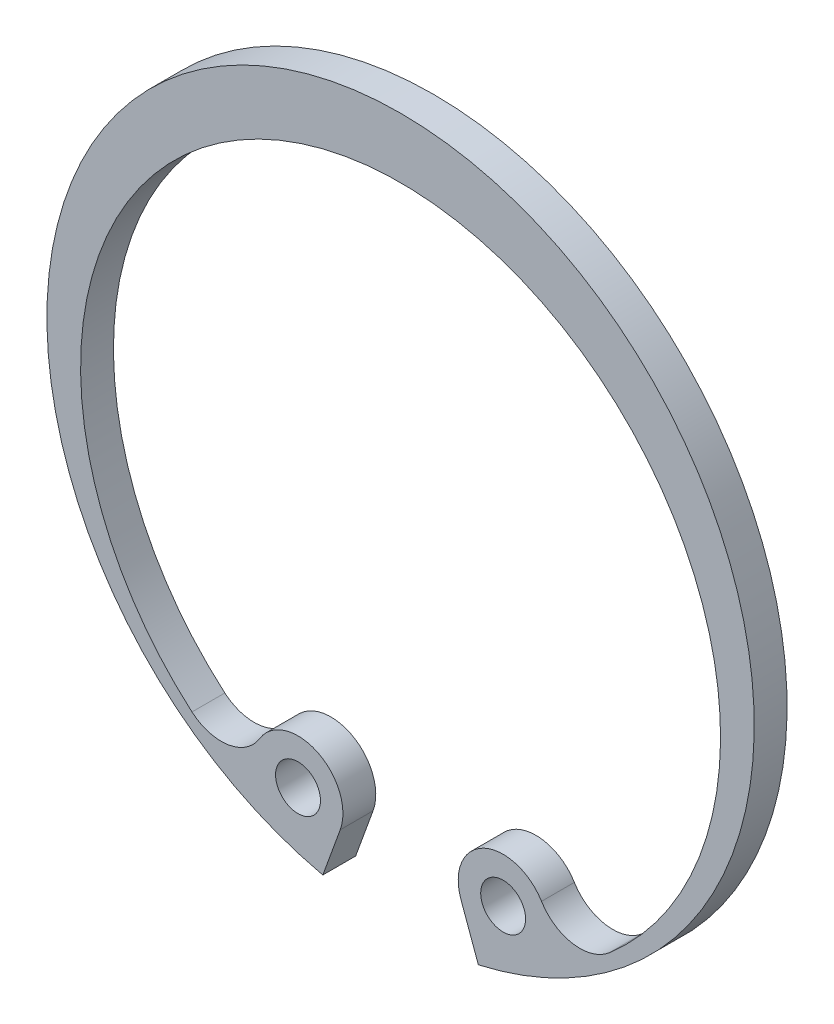
ISO-10303-21;
HEADER;
FILE_DESCRIPTION(('STEP AP214'),'2;1');
FILE_NAME('part.step','',(''),(''),'','','');
FILE_SCHEMA(('AUTOMOTIVE_DESIGN { 1 0 10303 214 1 1 1 1 }'));
ENDSEC;
DATA;
#1=APPLICATION_CONTEXT('core data for automotive mechanical design processes');
#2=APPLICATION_PROTOCOL_DEFINITION('international standard','automotive_design',2000,#1);
#3=PRODUCT_CONTEXT('',#1,'mechanical');
#4=PRODUCT('Part','Part','',(#3));
#5=PRODUCT_RELATED_PRODUCT_CATEGORY('part','',(#4));
#6=PRODUCT_DEFINITION_FORMATION('','',#4);
#7=PRODUCT_DEFINITION_CONTEXT('part definition',#1,'design');
#8=PRODUCT_DEFINITION('design','',#6,#7);
#9=PRODUCT_DEFINITION_SHAPE('','',#8);
#10=(LENGTH_UNIT() NAMED_UNIT(*) SI_UNIT(.MILLI.,.METRE.));
#11=(NAMED_UNIT(*) PLANE_ANGLE_UNIT() SI_UNIT($,.RADIAN.));
#12=(NAMED_UNIT(*) SI_UNIT($,.STERADIAN.) SOLID_ANGLE_UNIT());
#13=UNCERTAINTY_MEASURE_WITH_UNIT(LENGTH_MEASURE(1.E-05),#10,'distance_accuracy_value','');
#14=(GEOMETRIC_REPRESENTATION_CONTEXT(3) GLOBAL_UNCERTAINTY_ASSIGNED_CONTEXT((#13)) GLOBAL_UNIT_ASSIGNED_CONTEXT((#10,
#11,#12)) REPRESENTATION_CONTEXT('',''));
#15=CARTESIAN_POINT('',(0.,0.,0.));
#16=DIRECTION('',(0.,0.,1.));
#17=DIRECTION('',(1.,0.,0.));
#18=AXIS2_PLACEMENT_3D('',#15,#16,#17);
#19=CARTESIAN_POINT('',(0.,0.,0.975));
#20=DIRECTION('',(0.,0.,-1.));
#21=DIRECTION('',(-1.,0.,0.));
#22=AXIS2_PLACEMENT_3D('',#19,#20,#21);
#23=PLANE('',#22);
#24=CARTESIAN_POINT('',(-5.32360078088962,-6.98043795968956,0.975));
#25=DIRECTION('',(0.,0.,-1.));
#26=DIRECTION('',(-1.,0.,0.));
#27=AXIS2_PLACEMENT_3D('',#24,#25,#26);
#28=CIRCLE('',#27,1.33333333333333);
#29=CARTESIAN_POINT('',(-6.19276009205528,-7.99154619800622,0.975));
#30=VERTEX_POINT('',#29);
#31=CARTESIAN_POINT('',(-4.18415582842588,-7.67285617008171,0.975));
#32=VERTEX_POINT('',#31);
#33=EDGE_CURVE('E140',#30,#32,#28,.F.);
#34=ORIENTED_EDGE('',*,*,#33,.T.);
#35=CARTESIAN_POINT('',(-3.04471087596214,-8.36527438047387,0.975));
#36=DIRECTION('',(0.,0.,-1.));
#37=DIRECTION('',(-1.,0.,0.));
#38=AXIS2_PLACEMENT_3D('',#35,#36,#37);
#39=CIRCLE('',#38,1.33333333333333);
#40=CARTESIAN_POINT('',(-1.79178738158093,-8.82130123824143,0.975));
#41=VERTEX_POINT('',#40);
#42=EDGE_CURVE('E96',#41,#32,#39,.F.);
#43=ORIENTED_EDGE('',*,*,#42,.F.);
#44=DIRECTION('',(-0.34202014332567,-0.939692620785908,0.));
#45=VECTOR('',#44,1.);
#46=CARTESIAN_POINT('',(-1.79178738158093,-8.82130123824143,0.975));
#47=LINE('',#46,#45);
#48=CARTESIAN_POINT('',(-2.30921625274565,-10.2429253779404,0.975));
#49=VERTEX_POINT('',#48);
#50=EDGE_CURVE('E93',#41,#49,#47,.T.);
#51=ORIENTED_EDGE('',*,*,#50,.T.);
#52=CARTESIAN_POINT('',(0.,0.,0.975));
#53=DIRECTION('',(0.,0.,-1.));
#54=DIRECTION('',(-1.,0.,0.));
#55=AXIS2_PLACEMENT_3D('',#52,#53,#54);
#56=CIRCLE('',#55,10.5);
#57=CARTESIAN_POINT('',(2.30921625274565,-10.2429253779404,0.975));
#58=VERTEX_POINT('',#57);
#59=EDGE_CURVE('E81',#58,#49,#56,.F.);
#60=ORIENTED_EDGE('',*,*,#59,.F.);
#61=DIRECTION('',(-0.34202014332567,0.939692620785908,0.));
#62=VECTOR('',#61,1.);
#63=CARTESIAN_POINT('',(1.79178738158093,-8.82130123824143,0.975));
#64=LINE('',#63,#62);
#65=CARTESIAN_POINT('',(1.79178738158093,-8.82130123824143,0.975));
#66=VERTEX_POINT('',#65);
#67=EDGE_CURVE('E108',#58,#66,#64,.T.);
#68=ORIENTED_EDGE('',*,*,#67,.T.);
#69=CARTESIAN_POINT('',(3.04471087596214,-8.36527438047387,0.975));
#70=DIRECTION('',(0.,0.,-1.));
#71=DIRECTION('',(-1.,0.,0.));
#72=AXIS2_PLACEMENT_3D('',#69,#70,#71);
#73=CIRCLE('',#72,1.33333333333333);
#74=CARTESIAN_POINT('',(4.18415582842588,-7.67285617008171,0.975));
#75=VERTEX_POINT('',#74);
#76=EDGE_CURVE('E129',#75,#66,#73,.F.);
#77=ORIENTED_EDGE('',*,*,#76,.F.);
#78=CARTESIAN_POINT('',(5.32360078088962,-6.98043795968956,0.975));
#79=DIRECTION('',(0.,0.,-1.));
#80=DIRECTION('',(-1.,0.,0.));
#81=AXIS2_PLACEMENT_3D('',#78,#79,#80);
#82=CIRCLE('',#81,1.33333333333333);
#83=CARTESIAN_POINT('',(6.19276009205528,-7.99154619800622,0.975));
#84=VERTEX_POINT('',#83);
#85=EDGE_CURVE('E133',#75,#84,#82,.F.);
#86=ORIENTED_EDGE('',*,*,#85,.T.);
#87=CARTESIAN_POINT('',(0.,-0.7874,0.975));
#88=DIRECTION('',(0.,0.,-1.));
#89=DIRECTION('',(-1.,0.,0.));
#90=AXIS2_PLACEMENT_3D('',#87,#88,#89);
#91=CIRCLE('',#90,9.5);
#92=EDGE_CURVE('E137',#84,#30,#91,.F.);
#93=ORIENTED_EDGE('',*,*,#92,.T.);
#94=EDGE_LOOP('',(#34,#43,#51,#60,#68,#77,#86,#93));
#95=FACE_BOUND('',#94,.T.);
#96=CARTESIAN_POINT('',(3.04471087596214,-8.36527438047387,0.975));
#97=DIRECTION('',(0.,0.,-1.));
#98=DIRECTION('',(-1.,0.,0.));
#99=AXIS2_PLACEMENT_3D('',#96,#97,#98);
#100=CIRCLE('',#99,0.666666666666667);
#101=CARTESIAN_POINT('',(2.37804420929547,-8.36527438047387,0.975));
#102=VERTEX_POINT('',#101);
#103=EDGE_CURVE('E20',#102,#102,#100,.F.);
#104=ORIENTED_EDGE('',*,*,#103,.T.);
#105=EDGE_LOOP('',(#104));
#106=FACE_BOUND('',#105,.T.);
#107=CARTESIAN_POINT('',(-3.04471087596214,-8.36527438047387,0.975));
#108=DIRECTION('',(0.,0.,-1.));
#109=DIRECTION('',(-1.,0.,0.));
#110=AXIS2_PLACEMENT_3D('',#107,#108,#109);
#111=CIRCLE('',#110,0.666666666666667);
#112=CARTESIAN_POINT('',(-3.71137754262881,-8.36527438047387,0.975));
#113=VERTEX_POINT('',#112);
#114=EDGE_CURVE('E109',#113,#113,#111,.F.);
#115=ORIENTED_EDGE('',*,*,#114,.T.);
#116=EDGE_LOOP('',(#115));
#117=FACE_BOUND('',#116,.T.);
#118=ADVANCED_FACE('F17',(#95,#106,#117),#23,.T.);
#119=CARTESIAN_POINT('',(3.04471087596214,-8.36527438047387,1.95));
#120=DIRECTION('',(0.,0.,-1.));
#121=DIRECTION('',(-1.,0.,0.));
#122=AXIS2_PLACEMENT_3D('',#119,#120,#121);
#123=CYLINDRICAL_SURFACE('',#122,0.666666666666667);
#124=CARTESIAN_POINT('',(3.04471087596214,-8.36527438047387,1.95));
#125=DIRECTION('',(0.,0.,-1.));
#126=DIRECTION('',(-1.,0.,0.));
#127=AXIS2_PLACEMENT_3D('',#124,#125,#126);
#128=CIRCLE('',#127,0.666666666666667);
#129=CARTESIAN_POINT('',(2.37804420929547,-8.36527438047387,1.95));
#130=VERTEX_POINT('',#129);
#131=EDGE_CURVE('E124',#130,#130,#128,.T.);
#132=ORIENTED_EDGE('',*,*,#131,.F.);
#133=EDGE_LOOP('',(#132));
#134=FACE_BOUND('',#133,.T.);
#135=ORIENTED_EDGE('',*,*,#103,.F.);
#136=EDGE_LOOP('',(#135));
#137=FACE_BOUND('',#136,.T.);
#138=ADVANCED_FACE('F277',(#134,#137),#123,.F.);
#139=CARTESIAN_POINT('',(0.,0.,0.975));
#140=DIRECTION('',(0.,0.,-1.));
#141=DIRECTION('',(-1.,0.,0.));
#142=AXIS2_PLACEMENT_3D('',#139,#140,#141);
#143=CYLINDRICAL_SURFACE('',#142,10.5);
#144=ORIENTED_EDGE('',*,*,#59,.T.);
#145=DIRECTION('',(0.,0.,1.));
#146=VECTOR('',#145,1.);
#147=CARTESIAN_POINT('',(-2.30921625274565,-10.2429253779404,1.95));
#148=LINE('',#147,#146);
#149=CARTESIAN_POINT('',(-2.30921625274565,-10.2429253779404,1.95));
#150=VERTEX_POINT('',#149);
#151=EDGE_CURVE('E85',#49,#150,#148,.T.);
#152=ORIENTED_EDGE('',*,*,#151,.T.);
#153=CARTESIAN_POINT('',(0.,0.,1.95));
#154=DIRECTION('',(0.,0.,-1.));
#155=DIRECTION('',(-1.,0.,0.));
#156=AXIS2_PLACEMENT_3D('',#153,#154,#155);
#157=CIRCLE('',#156,10.5);
#158=CARTESIAN_POINT('',(2.30921625274565,-10.2429253779404,1.95));
#159=VERTEX_POINT('',#158);
#160=EDGE_CURVE('E122',#159,#150,#157,.F.);
#161=ORIENTED_EDGE('',*,*,#160,.F.);
#162=DIRECTION('',(0.,0.,1.));
#163=VECTOR('',#162,1.);
#164=CARTESIAN_POINT('',(2.30921625274565,-10.2429253779404,1.95));
#165=LINE('',#164,#163);
#166=EDGE_CURVE('E88',#159,#58,#165,.F.);
#167=ORIENTED_EDGE('',*,*,#166,.T.);
#168=EDGE_LOOP('',(#144,#152,#161,#167));
#169=FACE_BOUND('',#168,.T.);
#170=ADVANCED_FACE('F83',(#169),#143,.T.);
#171=CARTESIAN_POINT('',(-1.79178738158093,-8.82130123824143,1.95));
#172=DIRECTION('',(-0.939692620785908,0.34202014332567,0.));
#173=DIRECTION('',(-0.34202014332567,-0.939692620785908,0.));
#174=AXIS2_PLACEMENT_3D('',#171,#172,#173);
#175=PLANE('',#174);
#176=DIRECTION('',(0.,0.,-1.));
#177=VECTOR('',#176,1.);
#178=CARTESIAN_POINT('',(-1.79178738158093,-8.82130123824143,1.95));
#179=LINE('',#178,#177);
#180=CARTESIAN_POINT('',(-1.79178738158093,-8.82130123824143,1.95));
#181=VERTEX_POINT('',#180);
#182=EDGE_CURVE('E106',#181,#41,#179,.T.);
#183=ORIENTED_EDGE('',*,*,#182,.F.);
#184=DIRECTION('',(0.34202014332567,0.939692620785908,0.));
#185=VECTOR('',#184,1.);
#186=CARTESIAN_POINT('',(-2.30921625274565,-10.2429253779404,1.95));
#187=LINE('',#186,#185);
#188=EDGE_CURVE('E102',#150,#181,#187,.T.);
#189=ORIENTED_EDGE('',*,*,#188,.F.);
#190=ORIENTED_EDGE('',*,*,#151,.F.);
#191=ORIENTED_EDGE('',*,*,#50,.F.);
#192=EDGE_LOOP('',(#183,#189,#190,#191));
#193=FACE_BOUND('',#192,.T.);
#194=ADVANCED_FACE('F100',(#193),#175,.F.);
#195=CARTESIAN_POINT('',(-3.04471087596214,-8.36527438047387,1.95));
#196=DIRECTION('',(0.,0.,-1.));
#197=DIRECTION('',(-1.,0.,0.));
#198=AXIS2_PLACEMENT_3D('',#195,#196,#197);
#199=CYLINDRICAL_SURFACE('',#198,1.33333333333333);
#200=CARTESIAN_POINT('',(-3.04471087596214,-8.36527438047387,1.95));
#201=DIRECTION('',(0.,0.,-1.));
#202=DIRECTION('',(-1.,0.,0.));
#203=AXIS2_PLACEMENT_3D('',#200,#201,#202);
#204=CIRCLE('',#203,1.33333333333333);
#205=CARTESIAN_POINT('',(-4.18415582842588,-7.67285617008171,1.95));
#206=VERTEX_POINT('',#205);
#207=EDGE_CURVE('E119',#181,#206,#204,.F.);
#208=ORIENTED_EDGE('',*,*,#207,.F.);
#209=ORIENTED_EDGE('',*,*,#182,.T.);
#210=ORIENTED_EDGE('',*,*,#42,.T.);
#211=DIRECTION('',(0.,0.,-1.));
#212=VECTOR('',#211,1.);
#213=CARTESIAN_POINT('',(-4.18415582842588,-7.67285617008171,1.95));
#214=LINE('',#213,#212);
#215=EDGE_CURVE('E142',#32,#206,#214,.F.);
#216=ORIENTED_EDGE('',*,*,#215,.T.);
#217=EDGE_LOOP('',(#208,#209,#210,#216));
#218=FACE_BOUND('',#217,.T.);
#219=ADVANCED_FACE('F176',(#218),#199,.T.);
#220=CARTESIAN_POINT('',(-5.32360078088962,-6.98043795968956,1.95));
#221=DIRECTION('',(0.,0.,-1.));
#222=DIRECTION('',(-1.,0.,0.));
#223=AXIS2_PLACEMENT_3D('',#220,#221,#222);
#224=CYLINDRICAL_SURFACE('',#223,1.33333333333333);
#225=DIRECTION('',(0.,0.,-1.));
#226=VECTOR('',#225,1.);
#227=CARTESIAN_POINT('',(-6.19276009205527,-7.99154619800622,1.95));
#228=LINE('',#227,#226);
#229=CARTESIAN_POINT('',(-6.19276009205528,-7.99154619800622,1.95));
#230=VERTEX_POINT('',#229);
#231=EDGE_CURVE('E139',#30,#230,#228,.F.);
#232=ORIENTED_EDGE('',*,*,#231,.T.);
#233=CARTESIAN_POINT('',(-5.32360078088962,-6.98043795968956,1.95));
#234=DIRECTION('',(0.,0.,-1.));
#235=DIRECTION('',(-1.,0.,0.));
#236=AXIS2_PLACEMENT_3D('',#233,#234,#235);
#237=CIRCLE('',#236,1.33333333333333);
#238=EDGE_CURVE('E116',#206,#230,#237,.T.);
#239=ORIENTED_EDGE('',*,*,#238,.F.);
#240=ORIENTED_EDGE('',*,*,#215,.F.);
#241=ORIENTED_EDGE('',*,*,#33,.F.);
#242=EDGE_LOOP('',(#232,#239,#240,#241));
#243=FACE_BOUND('',#242,.T.);
#244=ADVANCED_FACE('F175',(#243),#224,.F.);
#245=CARTESIAN_POINT('',(0.,-0.7874,1.95));
#246=DIRECTION('',(0.,0.,-1.));
#247=DIRECTION('',(-1.,0.,0.));
#248=AXIS2_PLACEMENT_3D('',#245,#246,#247);
#249=CYLINDRICAL_SURFACE('',#248,9.5);
#250=DIRECTION('',(0.,0.,-1.));
#251=VECTOR('',#250,1.);
#252=CARTESIAN_POINT('',(6.19276009205528,-7.99154619800622,1.95));
#253=LINE('',#252,#251);
#254=CARTESIAN_POINT('',(6.19276009205528,-7.99154619800622,1.95));
#255=VERTEX_POINT('',#254);
#256=EDGE_CURVE('E136',#84,#255,#253,.F.);
#257=ORIENTED_EDGE('',*,*,#256,.T.);
#258=CARTESIAN_POINT('',(0.,-0.7874,1.95));
#259=DIRECTION('',(0.,0.,-1.));
#260=DIRECTION('',(-1.,0.,0.));
#261=AXIS2_PLACEMENT_3D('',#258,#259,#260);
#262=CIRCLE('',#261,9.5);
#263=EDGE_CURVE('E114',#230,#255,#262,.T.);
#264=ORIENTED_EDGE('',*,*,#263,.F.);
#265=ORIENTED_EDGE('',*,*,#231,.F.);
#266=ORIENTED_EDGE('',*,*,#92,.F.);
#267=EDGE_LOOP('',(#257,#264,#265,#266));
#268=FACE_BOUND('',#267,.T.);
#269=ADVANCED_FACE('F172',(#268),#249,.F.);
#270=CARTESIAN_POINT('',(5.32360078088962,-6.98043795968956,1.95));
#271=DIRECTION('',(0.,0.,-1.));
#272=DIRECTION('',(-1.,0.,0.));
#273=AXIS2_PLACEMENT_3D('',#270,#271,#272);
#274=CYLINDRICAL_SURFACE('',#273,1.33333333333333);
#275=DIRECTION('',(0.,0.,-1.));
#276=VECTOR('',#275,1.);
#277=CARTESIAN_POINT('',(4.18415582842588,-7.67285617008171,1.95));
#278=LINE('',#277,#276);
#279=CARTESIAN_POINT('',(4.18415582842588,-7.67285617008171,1.95));
#280=VERTEX_POINT('',#279);
#281=EDGE_CURVE('E132',#280,#75,#278,.T.);
#282=ORIENTED_EDGE('',*,*,#281,.F.);
#283=CARTESIAN_POINT('',(5.32360078088962,-6.98043795968956,1.95));
#284=DIRECTION('',(0.,0.,-1.));
#285=DIRECTION('',(-1.,0.,0.));
#286=AXIS2_PLACEMENT_3D('',#283,#284,#285);
#287=CIRCLE('',#286,1.33333333333333);
#288=EDGE_CURVE('E112',#255,#280,#287,.T.);
#289=ORIENTED_EDGE('',*,*,#288,.F.);
#290=ORIENTED_EDGE('',*,*,#256,.F.);
#291=ORIENTED_EDGE('',*,*,#85,.F.);
#292=EDGE_LOOP('',(#282,#289,#290,#291));
#293=FACE_BOUND('',#292,.T.);
#294=ADVANCED_FACE('F166',(#293),#274,.F.);
#295=CARTESIAN_POINT('',(3.04471087596214,-8.36527438047387,1.95));
#296=DIRECTION('',(0.,0.,-1.));
#297=DIRECTION('',(-1.,0.,0.));
#298=AXIS2_PLACEMENT_3D('',#295,#296,#297);
#299=CYLINDRICAL_SURFACE('',#298,1.33333333333333);
#300=ORIENTED_EDGE('',*,*,#76,.T.);
#301=DIRECTION('',(0.,0.,1.));
#302=VECTOR('',#301,1.);
#303=CARTESIAN_POINT('',(1.79178738158093,-8.82130123824143,1.95));
#304=LINE('',#303,#302);
#305=CARTESIAN_POINT('',(1.79178738158093,-8.82130123824143,1.95));
#306=VERTEX_POINT('',#305);
#307=EDGE_CURVE('E131',#66,#306,#304,.T.);
#308=ORIENTED_EDGE('',*,*,#307,.T.);
#309=CARTESIAN_POINT('',(3.04471087596214,-8.36527438047387,1.95));
#310=DIRECTION('',(0.,0.,-1.));
#311=DIRECTION('',(-1.,0.,0.));
#312=AXIS2_PLACEMENT_3D('',#309,#310,#311);
#313=CIRCLE('',#312,1.33333333333333);
#314=EDGE_CURVE('E35',#280,#306,#313,.F.);
#315=ORIENTED_EDGE('',*,*,#314,.F.);
#316=ORIENTED_EDGE('',*,*,#281,.T.);
#317=EDGE_LOOP('',(#300,#308,#315,#316));
#318=FACE_BOUND('',#317,.T.);
#319=ADVANCED_FACE('F168',(#318),#299,.T.);
#320=CARTESIAN_POINT('',(1.79178738158093,-8.82130123824143,1.95));
#321=DIRECTION('',(0.939692620785908,0.34202014332567,0.));
#322=DIRECTION('',(-0.34202014332567,0.939692620785908,0.));
#323=AXIS2_PLACEMENT_3D('',#320,#321,#322);
#324=PLANE('',#323);
#325=ORIENTED_EDGE('',*,*,#166,.F.);
#326=DIRECTION('',(0.34202014332567,-0.939692620785908,0.));
#327=VECTOR('',#326,1.);
#328=CARTESIAN_POINT('',(1.79178738158093,-8.82130123824143,1.95));
#329=LINE('',#328,#327);
#330=EDGE_CURVE('E26',#306,#159,#329,.T.);
#331=ORIENTED_EDGE('',*,*,#330,.F.);
#332=ORIENTED_EDGE('',*,*,#307,.F.);
#333=ORIENTED_EDGE('',*,*,#67,.F.);
#334=EDGE_LOOP('',(#325,#331,#332,#333));
#335=FACE_BOUND('',#334,.T.);
#336=ADVANCED_FACE('F161',(#335),#324,.F.);
#337=CARTESIAN_POINT('',(-3.04471087596214,-8.36527438047387,1.95));
#338=DIRECTION('',(0.,0.,-1.));
#339=DIRECTION('',(-1.,0.,0.));
#340=AXIS2_PLACEMENT_3D('',#337,#338,#339);
#341=CYLINDRICAL_SURFACE('',#340,0.666666666666667);
#342=CARTESIAN_POINT('',(-3.04471087596214,-8.36527438047387,1.95));
#343=DIRECTION('',(0.,0.,-1.));
#344=DIRECTION('',(-1.,0.,0.));
#345=AXIS2_PLACEMENT_3D('',#342,#343,#344);
#346=CIRCLE('',#345,0.666666666666667);
#347=CARTESIAN_POINT('',(-3.71137754262881,-8.36527438047387,1.95));
#348=VERTEX_POINT('',#347);
#349=EDGE_CURVE('E11',#348,#348,#346,.T.);
#350=ORIENTED_EDGE('',*,*,#349,.F.);
#351=EDGE_LOOP('',(#350));
#352=FACE_BOUND('',#351,.T.);
#353=ORIENTED_EDGE('',*,*,#114,.F.);
#354=EDGE_LOOP('',(#353));
#355=FACE_BOUND('',#354,.T.);
#356=ADVANCED_FACE('F187',(#352,#355),#341,.F.);
#357=CARTESIAN_POINT('',(0.,0.,1.95));
#358=DIRECTION('',(0.,0.,1.));
#359=DIRECTION('',(1.,0.,0.));
#360=AXIS2_PLACEMENT_3D('',#357,#358,#359);
#361=PLANE('',#360);
#362=ORIENTED_EDGE('',*,*,#349,.T.);
#363=EDGE_LOOP('',(#362));
#364=FACE_BOUND('',#363,.T.);
#365=ORIENTED_EDGE('',*,*,#314,.T.);
#366=ORIENTED_EDGE('',*,*,#330,.T.);
#367=ORIENTED_EDGE('',*,*,#160,.T.);
#368=ORIENTED_EDGE('',*,*,#188,.T.);
#369=ORIENTED_EDGE('',*,*,#207,.T.);
#370=ORIENTED_EDGE('',*,*,#238,.T.);
#371=ORIENTED_EDGE('',*,*,#263,.T.);
#372=ORIENTED_EDGE('',*,*,#288,.T.);
#373=EDGE_LOOP('',(#365,#366,#367,#368,#369,#370,#371,#372));
#374=FACE_BOUND('',#373,.T.);
#375=ORIENTED_EDGE('',*,*,#131,.T.);
#376=EDGE_LOOP('',(#375));
#377=FACE_BOUND('',#376,.T.);
#378=ADVANCED_FACE('F157',(#364,#374,#377),#361,.T.);
#379=CLOSED_SHELL('',(#118,#138,#170,#194,#219,#244,#269,#294,#319,#336,#356,#378));
#380=MANIFOLD_SOLID_BREP('B1',#379);
#381=ADVANCED_BREP_SHAPE_REPRESENTATION('',(#18,#380),#14);
#382=SHAPE_DEFINITION_REPRESENTATION(#9,#381);
ENDSEC;
END-ISO-10303-21;
